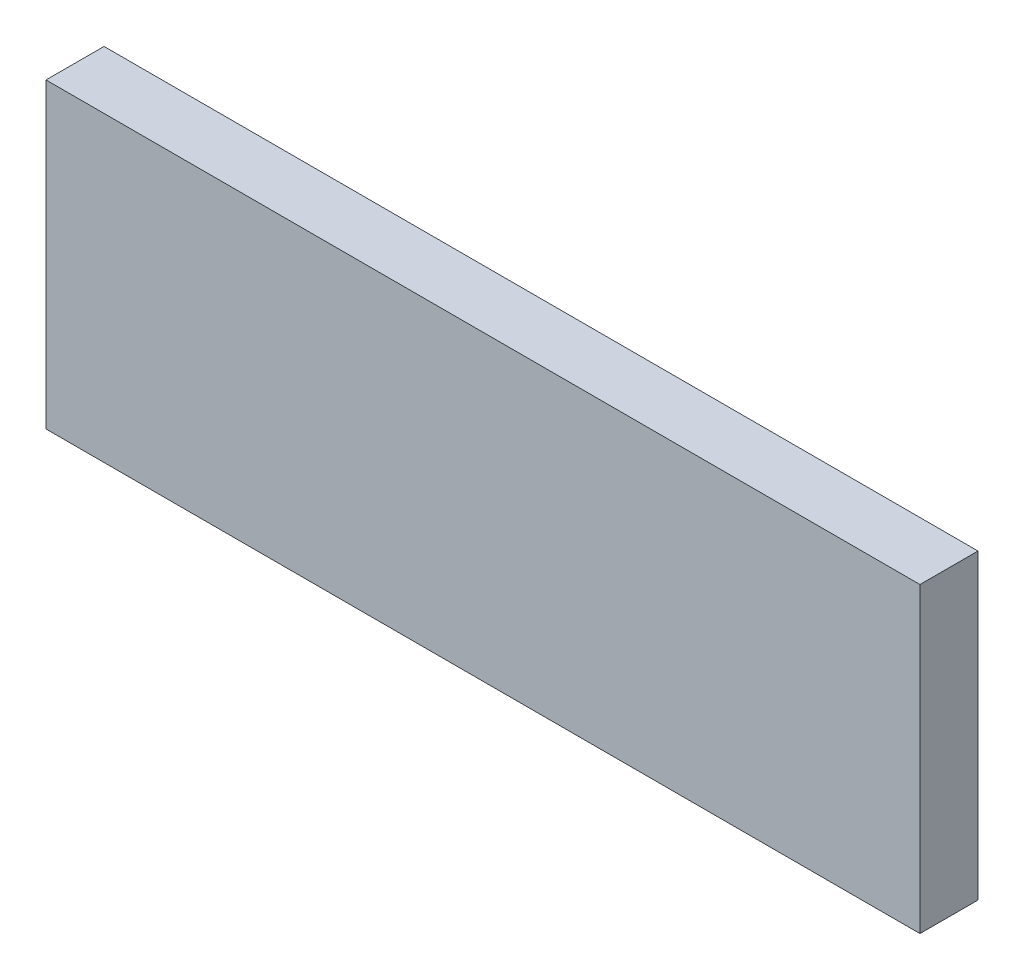
ISO-10303-21;
HEADER;
FILE_DESCRIPTION(('STEP AP214'),'2;1');
FILE_NAME('part.step','',(''),(''),'','','');
FILE_SCHEMA(('AUTOMOTIVE_DESIGN { 1 0 10303 214 1 1 1 1 }'));
ENDSEC;
DATA;
#1=APPLICATION_CONTEXT('core data for automotive mechanical design processes');
#2=APPLICATION_PROTOCOL_DEFINITION('international standard','automotive_design',2000,#1);
#3=PRODUCT_CONTEXT('',#1,'mechanical');
#4=PRODUCT('Part','Part','',(#3));
#5=PRODUCT_RELATED_PRODUCT_CATEGORY('part','',(#4));
#6=PRODUCT_DEFINITION_FORMATION('','',#4);
#7=PRODUCT_DEFINITION_CONTEXT('part definition',#1,'design');
#8=PRODUCT_DEFINITION('design','',#6,#7);
#9=PRODUCT_DEFINITION_SHAPE('','',#8);
#10=(LENGTH_UNIT() NAMED_UNIT(*) SI_UNIT(.MILLI.,.METRE.));
#11=(NAMED_UNIT(*) PLANE_ANGLE_UNIT() SI_UNIT($,.RADIAN.));
#12=(NAMED_UNIT(*) SI_UNIT($,.STERADIAN.) SOLID_ANGLE_UNIT());
#13=UNCERTAINTY_MEASURE_WITH_UNIT(LENGTH_MEASURE(1.E-05),#10,'distance_accuracy_value','');
#14=(GEOMETRIC_REPRESENTATION_CONTEXT(3) GLOBAL_UNCERTAINTY_ASSIGNED_CONTEXT((#13)) GLOBAL_UNIT_ASSIGNED_CONTEXT((#10,
#11,#12)) REPRESENTATION_CONTEXT('',''));
#15=CARTESIAN_POINT('',(0.,0.,0.));
#16=DIRECTION('',(0.,0.,1.));
#17=DIRECTION('',(1.,0.,0.));
#18=AXIS2_PLACEMENT_3D('',#15,#16,#17);
#19=CARTESIAN_POINT('',(1.80691028,-0.62500002,0.23999952));
#20=DIRECTION('',(0.,0.,1.));
#21=DIRECTION('',(1.,0.,0.));
#22=AXIS2_PLACEMENT_3D('',#19,#20,#21);
#23=PLANE('',#22);
#24=DIRECTION('',(0.,-1.,0.));
#25=VECTOR('',#24,1.);
#26=CARTESIAN_POINT('',(1.80691028,0.62500002,0.23999952));
#27=LINE('',#26,#25);
#28=CARTESIAN_POINT('',(1.80691028,0.62500002,0.23999952));
#29=VERTEX_POINT('',#28);
#30=CARTESIAN_POINT('',(1.80691028,-0.62500002,0.23999952));
#31=VERTEX_POINT('',#30);
#32=EDGE_CURVE('E27',#29,#31,#27,.T.);
#33=ORIENTED_EDGE('',*,*,#32,.F.);
#34=DIRECTION('',(1.,0.,0.));
#35=VECTOR('',#34,1.);
#36=CARTESIAN_POINT('',(-1.80690774,0.62500002,0.23999952));
#37=LINE('',#36,#35);
#38=CARTESIAN_POINT('',(-1.80690774,0.62500002,0.23999952));
#39=VERTEX_POINT('',#38);
#40=EDGE_CURVE('E84',#39,#29,#37,.T.);
#41=ORIENTED_EDGE('',*,*,#40,.F.);
#42=DIRECTION('',(0.,1.,0.));
#43=VECTOR('',#42,1.);
#44=CARTESIAN_POINT('',(-1.80690774,-0.62500002,0.23999952));
#45=LINE('',#44,#43);
#46=CARTESIAN_POINT('',(-1.80690774,-0.62500002,0.23999952));
#47=VERTEX_POINT('',#46);
#48=EDGE_CURVE('E91',#47,#39,#45,.T.);
#49=ORIENTED_EDGE('',*,*,#48,.F.);
#50=DIRECTION('',(-1.,0.,0.));
#51=VECTOR('',#50,1.);
#52=CARTESIAN_POINT('',(1.80691028,-0.62500002,0.23999952));
#53=LINE('',#52,#51);
#54=EDGE_CURVE('E94',#31,#47,#53,.T.);
#55=ORIENTED_EDGE('',*,*,#54,.F.);
#56=EDGE_LOOP('',(#33,#41,#49,#55));
#57=FACE_BOUND('',#56,.T.);
#58=ADVANCED_FACE('F17',(#57),#23,.T.);
#59=CARTESIAN_POINT('',(1.80691028,-0.62500002,0.));
#60=DIRECTION('',(0.,0.,1.));
#61=DIRECTION('',(1.,0.,0.));
#62=AXIS2_PLACEMENT_3D('',#59,#60,#61);
#63=PLANE('',#62);
#64=DIRECTION('',(-1.,0.,0.));
#65=VECTOR('',#64,1.);
#66=CARTESIAN_POINT('',(1.80691028,-0.62500002,0.));
#67=LINE('',#66,#65);
#68=CARTESIAN_POINT('',(1.80691028,-0.62500002,0.));
#69=VERTEX_POINT('',#68);
#70=CARTESIAN_POINT('',(-1.80690774,-0.62500002,0.));
#71=VERTEX_POINT('',#70);
#72=EDGE_CURVE('E87',#69,#71,#67,.T.);
#73=ORIENTED_EDGE('',*,*,#72,.T.);
#74=DIRECTION('',(0.,1.,0.));
#75=VECTOR('',#74,1.);
#76=CARTESIAN_POINT('',(-1.80690774,-0.62500002,0.));
#77=LINE('',#76,#75);
#78=CARTESIAN_POINT('',(-1.80690774,0.62500002,0.));
#79=VERTEX_POINT('',#78);
#80=EDGE_CURVE('E73',#71,#79,#77,.T.);
#81=ORIENTED_EDGE('',*,*,#80,.T.);
#82=DIRECTION('',(1.,0.,0.));
#83=VECTOR('',#82,1.);
#84=CARTESIAN_POINT('',(-1.80690774,0.62500002,0.));
#85=LINE('',#84,#83);
#86=CARTESIAN_POINT('',(1.80691028,0.62500002,0.));
#87=VERTEX_POINT('',#86);
#88=EDGE_CURVE('E21',#79,#87,#85,.T.);
#89=ORIENTED_EDGE('',*,*,#88,.T.);
#90=DIRECTION('',(0.,-1.,0.));
#91=VECTOR('',#90,1.);
#92=CARTESIAN_POINT('',(1.80691028,0.62500002,0.));
#93=LINE('',#92,#91);
#94=EDGE_CURVE('E11',#87,#69,#93,.T.);
#95=ORIENTED_EDGE('',*,*,#94,.T.);
#96=EDGE_LOOP('',(#73,#81,#89,#95));
#97=FACE_BOUND('',#96,.T.);
#98=ADVANCED_FACE('F19',(#97),#63,.F.);
#99=CARTESIAN_POINT('',(1.80691028,0.62500002,0.));
#100=DIRECTION('',(1.,0.,0.));
#101=DIRECTION('',(0.,1.,0.));
#102=AXIS2_PLACEMENT_3D('',#99,#100,#101);
#103=PLANE('',#102);
#104=DIRECTION('',(0.,0.,1.));
#105=VECTOR('',#104,1.);
#106=CARTESIAN_POINT('',(1.80691028,0.62500002,0.));
#107=LINE('',#106,#105);
#108=EDGE_CURVE('E104',#87,#29,#107,.T.);
#109=ORIENTED_EDGE('',*,*,#108,.T.);
#110=ORIENTED_EDGE('',*,*,#32,.T.);
#111=DIRECTION('',(0.,0.,1.));
#112=VECTOR('',#111,1.);
#113=CARTESIAN_POINT('',(1.80691028,-0.62500002,0.));
#114=LINE('',#113,#112);
#115=EDGE_CURVE('E101',#69,#31,#114,.T.);
#116=ORIENTED_EDGE('',*,*,#115,.F.);
#117=ORIENTED_EDGE('',*,*,#94,.F.);
#118=EDGE_LOOP('',(#109,#110,#116,#117));
#119=FACE_BOUND('',#118,.T.);
#120=ADVANCED_FACE('F117',(#119),#103,.T.);
#121=CARTESIAN_POINT('',(-1.80690774,0.62500002,0.));
#122=DIRECTION('',(0.,1.,0.));
#123=DIRECTION('',(1.,0.,0.));
#124=AXIS2_PLACEMENT_3D('',#121,#122,#123);
#125=PLANE('',#124);
#126=DIRECTION('',(0.,0.,1.));
#127=VECTOR('',#126,1.);
#128=CARTESIAN_POINT('',(-1.80690774,0.62500002,0.));
#129=LINE('',#128,#127);
#130=EDGE_CURVE('E81',#79,#39,#129,.T.);
#131=ORIENTED_EDGE('',*,*,#130,.T.);
#132=ORIENTED_EDGE('',*,*,#40,.T.);
#133=ORIENTED_EDGE('',*,*,#108,.F.);
#134=ORIENTED_EDGE('',*,*,#88,.F.);
#135=EDGE_LOOP('',(#131,#132,#133,#134));
#136=FACE_BOUND('',#135,.T.);
#137=ADVANCED_FACE('F120',(#136),#125,.T.);
#138=CARTESIAN_POINT('',(-1.80690774,-0.62500002,0.));
#139=DIRECTION('',(-1.,0.,0.));
#140=DIRECTION('',(0.,0.,1.));
#141=AXIS2_PLACEMENT_3D('',#138,#139,#140);
#142=PLANE('',#141);
#143=DIRECTION('',(0.,0.,1.));
#144=VECTOR('',#143,1.);
#145=CARTESIAN_POINT('',(-1.80690774,-0.62500002,0.));
#146=LINE('',#145,#144);
#147=EDGE_CURVE('E78',#71,#47,#146,.T.);
#148=ORIENTED_EDGE('',*,*,#147,.T.);
#149=ORIENTED_EDGE('',*,*,#48,.T.);
#150=ORIENTED_EDGE('',*,*,#130,.F.);
#151=ORIENTED_EDGE('',*,*,#80,.F.);
#152=EDGE_LOOP('',(#148,#149,#150,#151));
#153=FACE_BOUND('',#152,.T.);
#154=ADVANCED_FACE('F75',(#153),#142,.T.);
#155=CARTESIAN_POINT('',(1.80691028,-0.62500002,0.));
#156=DIRECTION('',(0.,-1.,0.));
#157=DIRECTION('',(0.,0.,-1.));
#158=AXIS2_PLACEMENT_3D('',#155,#156,#157);
#159=PLANE('',#158);
#160=ORIENTED_EDGE('',*,*,#115,.T.);
#161=ORIENTED_EDGE('',*,*,#54,.T.);
#162=ORIENTED_EDGE('',*,*,#147,.F.);
#163=ORIENTED_EDGE('',*,*,#72,.F.);
#164=EDGE_LOOP('',(#160,#161,#162,#163));
#165=FACE_BOUND('',#164,.T.);
#166=ADVANCED_FACE('F93',(#165),#159,.T.);
#167=CLOSED_SHELL('',(#58,#98,#120,#137,#154,#166));
#168=MANIFOLD_SOLID_BREP('B1',#167);
#169=ADVANCED_BREP_SHAPE_REPRESENTATION('',(#18,#168),#14);
#170=SHAPE_DEFINITION_REPRESENTATION(#9,#169);
ENDSEC;
END-ISO-10303-21;
